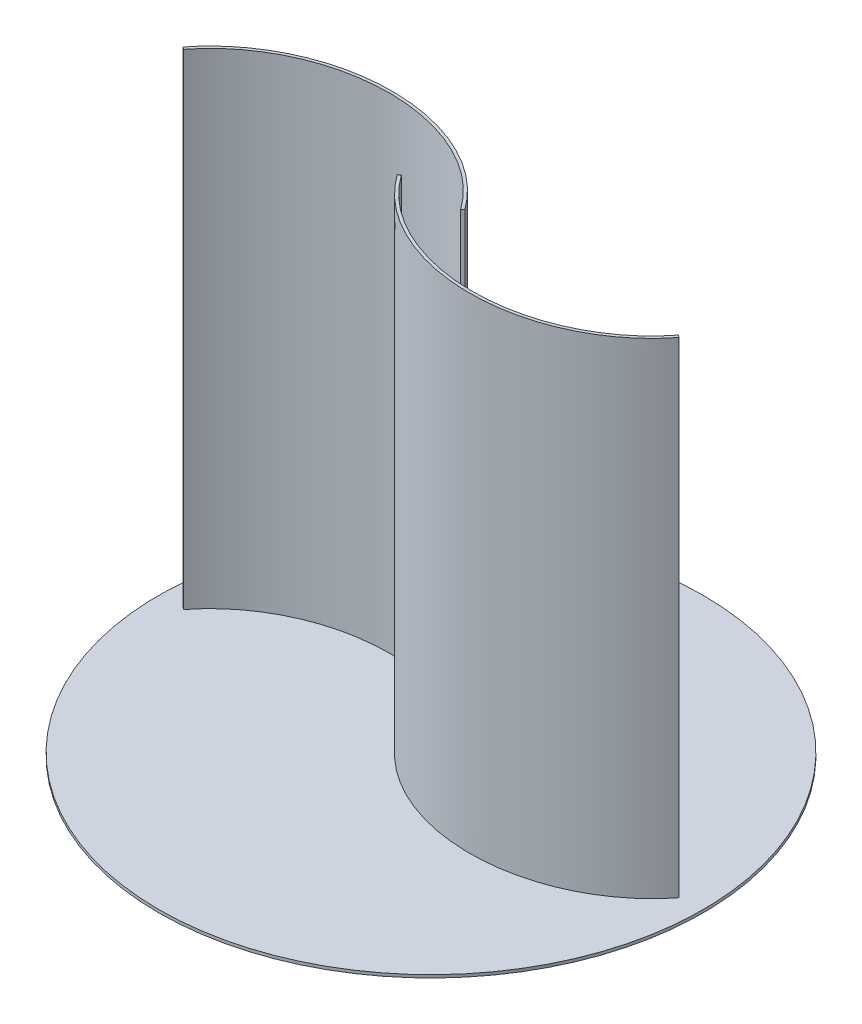
ISO-10303-21;
HEADER;
FILE_DESCRIPTION(('STEP AP214'),'2;1');
FILE_NAME('part.step','',(''),(''),'','','');
FILE_SCHEMA(('AUTOMOTIVE_DESIGN { 1 0 10303 214 1 1 1 1 }'));
ENDSEC;
DATA;
#1=APPLICATION_CONTEXT('core data for automotive mechanical design processes');
#2=APPLICATION_PROTOCOL_DEFINITION('international standard','automotive_design',2000,#1);
#3=PRODUCT_CONTEXT('',#1,'mechanical');
#4=PRODUCT('Part','Part','',(#3));
#5=PRODUCT_RELATED_PRODUCT_CATEGORY('part','',(#4));
#6=PRODUCT_DEFINITION_FORMATION('','',#4);
#7=PRODUCT_DEFINITION_CONTEXT('part definition',#1,'design');
#8=PRODUCT_DEFINITION('design','',#6,#7);
#9=PRODUCT_DEFINITION_SHAPE('','',#8);
#10=(LENGTH_UNIT() NAMED_UNIT(*) SI_UNIT(.MILLI.,.METRE.));
#11=(NAMED_UNIT(*) PLANE_ANGLE_UNIT() SI_UNIT($,.RADIAN.));
#12=(NAMED_UNIT(*) SI_UNIT($,.STERADIAN.) SOLID_ANGLE_UNIT());
#13=UNCERTAINTY_MEASURE_WITH_UNIT(LENGTH_MEASURE(1.E-05),#10,'distance_accuracy_value','');
#14=(GEOMETRIC_REPRESENTATION_CONTEXT(3) GLOBAL_UNCERTAINTY_ASSIGNED_CONTEXT((#13)) GLOBAL_UNIT_ASSIGNED_CONTEXT((#10,
#11,#12)) REPRESENTATION_CONTEXT('',''));
#15=CARTESIAN_POINT('',(0.,0.,0.));
#16=DIRECTION('',(0.,0.,1.));
#17=DIRECTION('',(1.,0.,0.));
#18=AXIS2_PLACEMENT_3D('',#15,#16,#17);
#19=CARTESIAN_POINT('',(0.,0.,0.));
#20=DIRECTION('',(0.,-1.,0.));
#21=DIRECTION('',(0.,0.,-1.));
#22=AXIS2_PLACEMENT_3D('',#19,#20,#21);
#23=PLANE('',#22);
#24=CARTESIAN_POINT('',(0.,0.,0.));
#25=DIRECTION('',(0.,-1.,0.));
#26=DIRECTION('',(0.,0.,-1.));
#27=AXIS2_PLACEMENT_3D('',#24,#25,#26);
#28=CIRCLE('',#27,280.5);
#29=CARTESIAN_POINT('',(0.,0.,-280.5));
#30=VERTEX_POINT('',#29);
#31=EDGE_CURVE('E133',#30,#30,#28,.T.);
#32=ORIENTED_EDGE('',*,*,#31,.F.);
#33=EDGE_LOOP('',(#32));
#34=FACE_BOUND('',#33,.T.);
#35=CARTESIAN_POINT('',(33.0451927941473,0.,-1.73811167634576));
#36=CARTESIAN_POINT('',(29.3253314184872,0.,-6.97124965866085));
#37=CARTESIAN_POINT('',(25.2176257591611,0.,-11.9921044919917));
#38=CARTESIAN_POINT('',(16.29295900648,0.,-21.5311522768435));
#39=CARTESIAN_POINT('',(11.4760419055099,0.,-26.0493166090416));
#40=CARTESIAN_POINT('',(1.21006722699719,0.,-34.5133467381479));
#41=CARTESIAN_POINT('',(-4.23894621330922,0.,-38.4591884806637));
#42=CARTESIAN_POINT('',(-15.682725138673,0.,-45.718247967155));
#43=CARTESIAN_POINT('',(-21.6774453697155,0.,-49.0314447800137));
#44=CARTESIAN_POINT('',(-34.1183127164376,0.,-54.9748706404852));
#45=CARTESIAN_POINT('',(-40.5644124824296,0.,-57.6050817093426));
#46=CARTESIAN_POINT('',(-53.8071626363303,0.,-62.1427579054054));
#47=CARTESIAN_POINT('',(-60.6037631254984,0.,-64.0502085679069));
#48=CARTESIAN_POINT('',(-74.4415449139929,0.,-67.1136405907596));
#49=CARTESIAN_POINT('',(-81.4826739145359,0.,-68.2696117858482));
#50=CARTESIAN_POINT('',(-95.6999834283976,0.,-69.8127888518585));
#51=CARTESIAN_POINT('',(-102.876109858721,0.,-70.1999895474854));
#52=CARTESIAN_POINT('',(-117.251923934591,0.,-70.1999895474854));
#53=CARTESIAN_POINT('',(-124.451556616485,0.,-69.8127891130524));
#54=CARTESIAN_POINT('',(-138.762571324868,0.,-68.2700859300607));
#55=CARTESIAN_POINT('',(-145.873898544061,0.,-67.1145890316524));
#56=CARTESIAN_POINT('',(-159.897819571624,0.,-64.0530357793261));
#57=CARTESIAN_POINT('',(-166.810359775546,0.,-62.1469907165298));
#58=CARTESIAN_POINT('',(-180.329183360728,0.,-57.6134697902052));
#59=CARTESIAN_POINT('',(-186.935415281964,0.,-54.9860102237033));
#60=CARTESIAN_POINT('',(-199.738637725169,0.,-49.0497589496216));
#61=CARTESIAN_POINT('',(-205.935579639696,0.,-45.7409878639663));
#62=CARTESIAN_POINT('',(-217.823279808775,0.,-38.492625566273));
#63=CARTESIAN_POINT('',(-223.513992632857,0.,-34.5530584810622));
#64=CARTESIAN_POINT('',(-234.299746055688,0.,-26.1033550785758));
#65=CARTESIAN_POINT('',(-239.394744204234,0.,-21.593245666391));
#66=CARTESIAN_POINT('',(-248.908350292699,0.,-12.0716793528765));
#67=CARTESIAN_POINT('',(-253.326918032932,0.,-7.06025190353449));
#68=CARTESIAN_POINT('',(-257.371935205023,0.,-1.83682426572968));
#69=B_SPLINE_CURVE_WITH_KNOTS('',3,(#35,#36,#37,#38,#39,#40,#41,#42,#43,#44,#45,#46,#47,#48,#49,
#50,#51,#52,#53,#54,#55,#56,#57,#58,#59,#60,#61,#62,#63,#64,#65,#66,#67,#68),.UNSPECIFIED.,.F.,
.F.,(4,2,2,2,2,2,2,2,2,2,2,2,2,2,2,2,4),(0.,0.0625,0.125,0.1875,0.25,0.3125,0.375,0.4375,0.5,
0.5625,0.625,0.6875,0.75,0.8125,0.875,0.9375,1.),.UNSPECIFIED.);
#70=CARTESIAN_POINT('',(33.0451927941473,0.,-1.73811167634581));
#71=VERTEX_POINT('',#70);
#72=CARTESIAN_POINT('',(-257.371935205023,0.,-1.83682426572968));
#73=VERTEX_POINT('',#72);
#74=EDGE_CURVE('E187',#71,#73,#69,.T.);
#75=ORIENTED_EDGE('',*,*,#74,.F.);
#76=DIRECTION('',(-0.815064264715779,0.,0.579370558781965));
#77=VECTOR('',#76,1.);
#78=CARTESIAN_POINT('',(33.0451927941473,0.,-1.73811167634581));
#79=LINE('',#78,#77);
#80=CARTESIAN_POINT('',(30.6,0.,0.));
#81=VERTEX_POINT('',#80);
#82=EDGE_CURVE('E201',#71,#81,#79,.T.);
#83=ORIENTED_EDGE('',*,*,#82,.T.);
#84=CARTESIAN_POINT('',(-114.679331484579,0.,78.0020448605837));
#85=DIRECTION('',(0.,1.,0.));
#86=DIRECTION('',(-0.996194698091746,0.,0.0871557427476549));
#87=AXIS2_PLACEMENT_3D('',#84,#85,#86);
#88=ELLIPSE('',#87,169.539126486376,145.);
#89=CARTESIAN_POINT('',(-255.,0.,0.));
#90=VERTEX_POINT('',#89);
#91=EDGE_CURVE('E198',#81,#90,#88,.T.);
#92=ORIENTED_EDGE('',*,*,#91,.T.);
#93=DIRECTION('',(-0.790645068340939,0.,-0.612274755243226));
#94=VECTOR('',#93,1.);
#95=CARTESIAN_POINT('',(-255.,0.,0.));
#96=LINE('',#95,#94);
#97=EDGE_CURVE('E191',#90,#73,#96,.T.);
#98=ORIENTED_EDGE('',*,*,#97,.T.);
#99=EDGE_LOOP('',(#75,#83,#92,#98));
#100=FACE_BOUND('',#99,.T.);
#101=CARTESIAN_POINT('',(-33.0451927941476,0.,1.73811167634623));
#102=CARTESIAN_POINT('',(-29.3253314184876,0.,6.97124965866137));
#103=CARTESIAN_POINT('',(-25.2176257591614,0.,11.9921044919922));
#104=CARTESIAN_POINT('',(-16.2929590064803,0.,21.5311522768441));
#105=CARTESIAN_POINT('',(-11.4760419055102,0.,26.0493166090423));
#106=CARTESIAN_POINT('',(-1.21006722699743,0.,34.5133467381487));
#107=CARTESIAN_POINT('',(4.23894621330905,0.,38.4591884806646));
#108=CARTESIAN_POINT('',(15.6827251386728,0.,45.718247967156));
#109=CARTESIAN_POINT('',(21.6774453697153,0.,49.0314447800146));
#110=CARTESIAN_POINT('',(34.1183127164374,0.,54.9748706404861));
#111=CARTESIAN_POINT('',(40.5644124824293,0.,57.6050817093436));
#112=CARTESIAN_POINT('',(53.8071626363301,0.,62.1427579054064));
#113=CARTESIAN_POINT('',(60.6037631254983,0.,64.0502085679079));
#114=CARTESIAN_POINT('',(74.4415449139928,0.,67.1136405907606));
#115=CARTESIAN_POINT('',(81.4826739145359,0.,68.2696117858492));
#116=CARTESIAN_POINT('',(95.6999834283976,0.,69.8127888518596));
#117=CARTESIAN_POINT('',(102.876109858721,0.,70.1999895474864));
#118=CARTESIAN_POINT('',(117.251923934591,0.,70.1999895474865));
#119=CARTESIAN_POINT('',(124.451556616485,0.,69.8127891130535));
#120=CARTESIAN_POINT('',(138.762571324868,0.,68.2700859300617));
#121=CARTESIAN_POINT('',(145.873898544061,0.,67.1145890316534));
#122=CARTESIAN_POINT('',(159.897819571624,0.,64.053035779327));
#123=CARTESIAN_POINT('',(166.810359775546,0.,62.1469907165307));
#124=CARTESIAN_POINT('',(180.329183360728,0.,57.6134697902061));
#125=CARTESIAN_POINT('',(186.935415281964,0.,54.9860102237042));
#126=CARTESIAN_POINT('',(199.738637725169,0.,49.0497589496224));
#127=CARTESIAN_POINT('',(205.935579639696,0.,45.7409878639671));
#128=CARTESIAN_POINT('',(217.823279808775,0.,38.4926255662737));
#129=CARTESIAN_POINT('',(223.513992632857,0.,34.5530584810628));
#130=CARTESIAN_POINT('',(234.299746055688,0.,26.1033550785763));
#131=CARTESIAN_POINT('',(239.394744204234,0.,21.5932456663915));
#132=CARTESIAN_POINT('',(248.908350292699,0.,12.0716793528769));
#133=CARTESIAN_POINT('',(253.326918032933,0.,7.06025190353481));
#134=CARTESIAN_POINT('',(257.371935205023,0.,1.83682426572999));
#135=B_SPLINE_CURVE_WITH_KNOTS('',3,(#101,#102,#103,#104,#105,#106,#107,#108,#109,#110,#111,
#112,#113,#114,#115,#116,#117,#118,#119,#120,#121,#122,#123,#124,#125,#126,#127,#128,#129,#130,
#131,#132,#133,#134),.UNSPECIFIED.,.F.,.F.,(4,2,2,2,2,2,2,2,2,2,2,2,2,2,2,2,4),(0.,0.0625,0.125,
0.1875,0.25,0.3125,0.375,0.4375,0.5,0.5625,0.625,0.6875,0.75,0.8125,0.875,0.9375,1.),.UNSPECIFIED.);
#136=CARTESIAN_POINT('',(-33.0451927941477,0.,1.73811167634617));
#137=VERTEX_POINT('',#136);
#138=CARTESIAN_POINT('',(257.371935205023,0.,1.83682426572994));
#139=VERTEX_POINT('',#138);
#140=EDGE_CURVE('E129',#137,#139,#135,.T.);
#141=ORIENTED_EDGE('',*,*,#140,.F.);
#142=DIRECTION('',(0.815064264715782,0.,-0.579370558781961));
#143=VECTOR('',#142,1.);
#144=CARTESIAN_POINT('',(-33.0451927941477,0.,1.73811167634617));
#145=LINE('',#144,#143);
#146=CARTESIAN_POINT('',(-30.6000000000003,0.,2.8796409701215E-13));
#147=VERTEX_POINT('',#146);
#148=EDGE_CURVE('E123',#137,#147,#145,.T.);
#149=ORIENTED_EDGE('',*,*,#148,.T.);
#150=CARTESIAN_POINT('',(114.679331484579,0.,-78.0020448605833));
#151=DIRECTION('',(0.,1.,0.));
#152=DIRECTION('',(0.996194698091746,0.,-0.0871557427476582));
#153=AXIS2_PLACEMENT_3D('',#150,#151,#152);
#154=ELLIPSE('',#153,169.539126486376,145.000000000001);
#155=CARTESIAN_POINT('',(255.,0.,2.63677968348475E-13));
#156=VERTEX_POINT('',#155);
#157=EDGE_CURVE('E55',#147,#156,#154,.T.);
#158=ORIENTED_EDGE('',*,*,#157,.T.);
#159=DIRECTION('',(0.790645068340941,0.,0.612274755243223));
#160=VECTOR('',#159,1.);
#161=CARTESIAN_POINT('',(255.,0.,2.63677968348475E-13));
#162=LINE('',#161,#160);
#163=EDGE_CURVE('E233',#156,#139,#162,.T.);
#164=ORIENTED_EDGE('',*,*,#163,.T.);
#165=EDGE_LOOP('',(#141,#149,#158,#164));
#166=FACE_BOUND('',#165,.T.);
#167=ADVANCED_FACE('F39',(#34,#100,#166),#23,.F.);
#168=CARTESIAN_POINT('',(33.0451927941473,500.,-1.73811167634576));
#169=CARTESIAN_POINT('',(29.3253314184872,500.,-6.97124965866085));
#170=CARTESIAN_POINT('',(25.2176257591611,500.,-11.9921044919917));
#171=CARTESIAN_POINT('',(16.29295900648,500.,-21.5311522768435));
#172=CARTESIAN_POINT('',(11.4760419055099,500.,-26.0493166090416));
#173=CARTESIAN_POINT('',(1.21006722699719,500.,-34.5133467381479));
#174=CARTESIAN_POINT('',(-4.23894621330922,500.,-38.4591884806637));
#175=CARTESIAN_POINT('',(-15.682725138673,500.,-45.718247967155));
#176=CARTESIAN_POINT('',(-21.6774453697155,500.,-49.0314447800137));
#177=CARTESIAN_POINT('',(-34.1183127164376,500.,-54.9748706404852));
#178=CARTESIAN_POINT('',(-40.5644124824296,500.,-57.6050817093426));
#179=CARTESIAN_POINT('',(-53.8071626363303,500.,-62.1427579054054));
#180=CARTESIAN_POINT('',(-60.6037631254984,500.,-64.0502085679069));
#181=CARTESIAN_POINT('',(-74.4415449139929,500.,-67.1136405907596));
#182=CARTESIAN_POINT('',(-81.4826739145359,500.,-68.2696117858482));
#183=CARTESIAN_POINT('',(-95.6999834283976,500.,-69.8127888518585));
#184=CARTESIAN_POINT('',(-102.876109858721,500.,-70.1999895474854));
#185=CARTESIAN_POINT('',(-117.251923934591,500.,-70.1999895474854));
#186=CARTESIAN_POINT('',(-124.451556616485,500.,-69.8127891130524));
#187=CARTESIAN_POINT('',(-138.762571324868,500.,-68.2700859300607));
#188=CARTESIAN_POINT('',(-145.873898544061,500.,-67.1145890316524));
#189=CARTESIAN_POINT('',(-159.897819571624,500.,-64.0530357793261));
#190=CARTESIAN_POINT('',(-166.810359775546,500.,-62.1469907165298));
#191=CARTESIAN_POINT('',(-180.329183360728,500.,-57.6134697902052));
#192=CARTESIAN_POINT('',(-186.935415281964,500.,-54.9860102237033));
#193=CARTESIAN_POINT('',(-199.738637725169,500.,-49.0497589496216));
#194=CARTESIAN_POINT('',(-205.935579639696,500.,-45.7409878639663));
#195=CARTESIAN_POINT('',(-217.823279808775,500.,-38.492625566273));
#196=CARTESIAN_POINT('',(-223.513992632857,500.,-34.5530584810622));
#197=CARTESIAN_POINT('',(-234.299746055688,500.,-26.1033550785758));
#198=CARTESIAN_POINT('',(-239.394744204234,500.,-21.593245666391));
#199=CARTESIAN_POINT('',(-248.908350292699,500.,-12.0716793528765));
#200=CARTESIAN_POINT('',(-253.326918032932,500.,-7.06025190353449));
#201=CARTESIAN_POINT('',(-257.371935205023,500.,-1.83682426572968));
#202=B_SPLINE_CURVE_WITH_KNOTS('',3,(#168,#169,#170,#171,#172,#173,#174,#175,#176,#177,#178,
#179,#180,#181,#182,#183,#184,#185,#186,#187,#188,#189,#190,#191,#192,#193,#194,#195,#196,#197,
#198,#199,#200,#201),.UNSPECIFIED.,.F.,.F.,(4,2,2,2,2,2,2,2,2,2,2,2,2,2,2,2,4),(0.,0.0625,0.125,
0.1875,0.25,0.3125,0.375,0.4375,0.5,0.5625,0.625,0.6875,0.75,0.8125,0.875,0.9375,1.),.UNSPECIFIED.);
#203=DIRECTION('',(0.,-1.,0.));
#204=VECTOR('',#203,1.);
#205=SURFACE_OF_LINEAR_EXTRUSION('',#202,#204);
#206=ORIENTED_EDGE('',*,*,#74,.T.);
#207=DIRECTION('',(0.,-1.,0.));
#208=VECTOR('',#207,1.);
#209=CARTESIAN_POINT('',(-257.371935205023,500.,-1.83682426572968));
#210=LINE('',#209,#208);
#211=CARTESIAN_POINT('',(-257.371935205023,500.,-1.83682426572968));
#212=VERTEX_POINT('',#211);
#213=EDGE_CURVE('E11',#212,#73,#210,.T.);
#214=ORIENTED_EDGE('',*,*,#213,.F.);
#215=CARTESIAN_POINT('',(33.0451927941473,500.,-1.73811167634581));
#216=VERTEX_POINT('',#215);
#217=EDGE_CURVE('E86',#216,#212,#202,.T.);
#218=ORIENTED_EDGE('',*,*,#217,.F.);
#219=DIRECTION('',(0.,-1.,0.));
#220=VECTOR('',#219,1.);
#221=CARTESIAN_POINT('',(33.0451927941473,500.,-1.73811167634581));
#222=LINE('',#221,#220);
#223=EDGE_CURVE('E64',#216,#71,#222,.T.);
#224=ORIENTED_EDGE('',*,*,#223,.T.);
#225=EDGE_LOOP('',(#206,#214,#218,#224));
#226=FACE_BOUND('',#225,.T.);
#227=ADVANCED_FACE('F41',(#226),#205,.F.);
#228=CARTESIAN_POINT('',(-255.,500.,0.));
#229=DIRECTION('',(-0.612274755243226,0.,0.790645068340939));
#230=DIRECTION('',(0.790645068340939,0.,0.612274755243226));
#231=AXIS2_PLACEMENT_3D('',#228,#229,#230);
#232=PLANE('',#231);
#233=ORIENTED_EDGE('',*,*,#97,.F.);
#234=DIRECTION('',(0.,-1.,0.));
#235=VECTOR('',#234,1.);
#236=CARTESIAN_POINT('',(-255.,500.,0.));
#237=LINE('',#236,#235);
#238=CARTESIAN_POINT('',(-255.,500.,0.));
#239=VERTEX_POINT('',#238);
#240=EDGE_CURVE('E48',#239,#90,#237,.T.);
#241=ORIENTED_EDGE('',*,*,#240,.F.);
#242=DIRECTION('',(-0.790645068340939,0.,-0.612274755243226));
#243=VECTOR('',#242,1.);
#244=CARTESIAN_POINT('',(-255.,500.,0.));
#245=LINE('',#244,#243);
#246=EDGE_CURVE('E185',#239,#212,#245,.T.);
#247=ORIENTED_EDGE('',*,*,#246,.T.);
#248=ORIENTED_EDGE('',*,*,#213,.T.);
#249=EDGE_LOOP('',(#233,#241,#247,#248));
#250=FACE_BOUND('',#249,.T.);
#251=ADVANCED_FACE('F177',(#250),#232,.T.);
#252=CARTESIAN_POINT('',(-114.679331484579,500.,78.0020448605837));
#253=DIRECTION('',(0.,1.,0.));
#254=DIRECTION('',(-0.996194698091746,0.,0.0871557427476549));
#255=AXIS2_PLACEMENT_3D('',#252,#253,#254);
#256=ELLIPSE('',#255,169.539126486376,145.);
#257=DIRECTION('',(0.,-1.,0.));
#258=VECTOR('',#257,1.);
#259=SURFACE_OF_LINEAR_EXTRUSION('',#256,#258);
#260=ORIENTED_EDGE('',*,*,#91,.F.);
#261=DIRECTION('',(0.,-1.,0.));
#262=VECTOR('',#261,1.);
#263=CARTESIAN_POINT('',(30.6,500.,0.));
#264=LINE('',#263,#262);
#265=CARTESIAN_POINT('',(30.6,500.,0.));
#266=VERTEX_POINT('',#265);
#267=EDGE_CURVE('E205',#266,#81,#264,.T.);
#268=ORIENTED_EDGE('',*,*,#267,.F.);
#269=EDGE_CURVE('E179',#266,#239,#256,.T.);
#270=ORIENTED_EDGE('',*,*,#269,.T.);
#271=ORIENTED_EDGE('',*,*,#240,.T.);
#272=EDGE_LOOP('',(#260,#268,#270,#271));
#273=FACE_BOUND('',#272,.T.);
#274=ADVANCED_FACE('F174',(#273),#259,.T.);
#275=CARTESIAN_POINT('',(33.0451927941473,500.,-1.73811167634581));
#276=DIRECTION('',(0.579370558781965,0.,0.815064264715779));
#277=DIRECTION('',(0.815064264715779,0.,-0.579370558781965));
#278=AXIS2_PLACEMENT_3D('',#275,#276,#277);
#279=PLANE('',#278);
#280=ORIENTED_EDGE('',*,*,#82,.F.);
#281=ORIENTED_EDGE('',*,*,#223,.F.);
#282=DIRECTION('',(-0.815064264715779,0.,0.579370558781965));
#283=VECTOR('',#282,1.);
#284=CARTESIAN_POINT('',(33.0451927941473,500.,-1.73811167634581));
#285=LINE('',#284,#283);
#286=EDGE_CURVE('E184',#216,#266,#285,.T.);
#287=ORIENTED_EDGE('',*,*,#286,.T.);
#288=ORIENTED_EDGE('',*,*,#267,.T.);
#289=EDGE_LOOP('',(#280,#281,#287,#288));
#290=FACE_BOUND('',#289,.T.);
#291=ADVANCED_FACE('F171',(#290),#279,.T.);
#292=CARTESIAN_POINT('',(-110.064016896656,500.,-70.1999895474854));
#293=DIRECTION('',(0.,-1.,0.));
#294=DIRECTION('',(-1.,0.,0.));
#295=AXIS2_PLACEMENT_3D('',#292,#293,#294);
#296=PLANE('',#295);
#297=ORIENTED_EDGE('',*,*,#217,.T.);
#298=ORIENTED_EDGE('',*,*,#246,.F.);
#299=ORIENTED_EDGE('',*,*,#269,.F.);
#300=ORIENTED_EDGE('',*,*,#286,.F.);
#301=EDGE_LOOP('',(#297,#298,#299,#300));
#302=FACE_BOUND('',#301,.T.);
#303=ADVANCED_FACE('F167',(#302),#296,.F.);
#304=CARTESIAN_POINT('',(0.,-3.,0.));
#305=DIRECTION('',(0.,1.,0.));
#306=DIRECTION('',(0.,0.,1.));
#307=AXIS2_PLACEMENT_3D('',#304,#305,#306);
#308=CYLINDRICAL_SURFACE('',#307,280.5);
#309=CARTESIAN_POINT('',(0.,-3.,0.));
#310=DIRECTION('',(0.,-1.,0.));
#311=DIRECTION('',(0.,0.,-1.));
#312=AXIS2_PLACEMENT_3D('',#309,#310,#311);
#313=CIRCLE('',#312,280.5);
#314=CARTESIAN_POINT('',(0.,-3.,-280.5));
#315=VERTEX_POINT('',#314);
#316=EDGE_CURVE('E192',#315,#315,#313,.T.);
#317=ORIENTED_EDGE('',*,*,#316,.F.);
#318=EDGE_LOOP('',(#317));
#319=FACE_BOUND('',#318,.T.);
#320=ORIENTED_EDGE('',*,*,#31,.T.);
#321=EDGE_LOOP('',(#320));
#322=FACE_BOUND('',#321,.T.);
#323=ADVANCED_FACE('F160',(#319,#322),#308,.T.);
#324=CARTESIAN_POINT('',(0.,-3.,0.));
#325=DIRECTION('',(0.,-1.,0.));
#326=DIRECTION('',(0.,0.,-1.));
#327=AXIS2_PLACEMENT_3D('',#324,#325,#326);
#328=PLANE('',#327);
#329=ORIENTED_EDGE('',*,*,#316,.T.);
#330=EDGE_LOOP('',(#329));
#331=FACE_BOUND('',#330,.T.);
#332=ADVANCED_FACE('F157',(#331),#328,.T.);
#333=CARTESIAN_POINT('',(-33.0451927941476,500.,1.73811167634623));
#334=CARTESIAN_POINT('',(-29.3253314184876,500.,6.97124965866137));
#335=CARTESIAN_POINT('',(-25.2176257591614,500.,11.9921044919922));
#336=CARTESIAN_POINT('',(-16.2929590064803,500.,21.5311522768441));
#337=CARTESIAN_POINT('',(-11.4760419055102,500.,26.0493166090423));
#338=CARTESIAN_POINT('',(-1.21006722699743,500.,34.5133467381487));
#339=CARTESIAN_POINT('',(4.23894621330905,500.,38.4591884806646));
#340=CARTESIAN_POINT('',(15.6827251386728,500.,45.718247967156));
#341=CARTESIAN_POINT('',(21.6774453697153,500.,49.0314447800146));
#342=CARTESIAN_POINT('',(34.1183127164374,500.,54.9748706404861));
#343=CARTESIAN_POINT('',(40.5644124824293,500.,57.6050817093436));
#344=CARTESIAN_POINT('',(53.8071626363301,500.,62.1427579054064));
#345=CARTESIAN_POINT('',(60.6037631254983,500.,64.0502085679079));
#346=CARTESIAN_POINT('',(74.4415449139928,500.,67.1136405907606));
#347=CARTESIAN_POINT('',(81.4826739145359,500.,68.2696117858492));
#348=CARTESIAN_POINT('',(95.6999834283976,500.,69.8127888518596));
#349=CARTESIAN_POINT('',(102.876109858721,500.,70.1999895474864));
#350=CARTESIAN_POINT('',(117.251923934591,500.,70.1999895474865));
#351=CARTESIAN_POINT('',(124.451556616485,500.,69.8127891130535));
#352=CARTESIAN_POINT('',(138.762571324868,500.,68.2700859300617));
#353=CARTESIAN_POINT('',(145.873898544061,500.,67.1145890316534));
#354=CARTESIAN_POINT('',(159.897819571624,500.,64.053035779327));
#355=CARTESIAN_POINT('',(166.810359775546,500.,62.1469907165307));
#356=CARTESIAN_POINT('',(180.329183360728,500.,57.6134697902061));
#357=CARTESIAN_POINT('',(186.935415281964,500.,54.9860102237042));
#358=CARTESIAN_POINT('',(199.738637725169,500.,49.0497589496224));
#359=CARTESIAN_POINT('',(205.935579639696,500.,45.7409878639671));
#360=CARTESIAN_POINT('',(217.823279808775,500.,38.4926255662737));
#361=CARTESIAN_POINT('',(223.513992632857,500.,34.5530584810628));
#362=CARTESIAN_POINT('',(234.299746055688,500.,26.1033550785763));
#363=CARTESIAN_POINT('',(239.394744204234,500.,21.5932456663915));
#364=CARTESIAN_POINT('',(248.908350292699,500.,12.0716793528769));
#365=CARTESIAN_POINT('',(253.326918032933,500.,7.06025190353481));
#366=CARTESIAN_POINT('',(257.371935205023,500.,1.83682426572999));
#367=B_SPLINE_CURVE_WITH_KNOTS('',3,(#333,#334,#335,#336,#337,#338,#339,#340,#341,#342,#343,
#344,#345,#346,#347,#348,#349,#350,#351,#352,#353,#354,#355,#356,#357,#358,#359,#360,#361,#362,
#363,#364,#365,#366),.UNSPECIFIED.,.F.,.F.,(4,2,2,2,2,2,2,2,2,2,2,2,2,2,2,2,4),(0.,0.0625,0.125,
0.1875,0.25,0.3125,0.375,0.4375,0.5,0.5625,0.625,0.6875,0.75,0.8125,0.875,0.9375,1.),.UNSPECIFIED.);
#368=DIRECTION('',(0.,-1.,0.));
#369=VECTOR('',#368,1.);
#370=SURFACE_OF_LINEAR_EXTRUSION('',#367,#369);
#371=ORIENTED_EDGE('',*,*,#140,.T.);
#372=DIRECTION('',(0.,-1.,0.));
#373=VECTOR('',#372,1.);
#374=CARTESIAN_POINT('',(257.371935205023,500.,1.83682426572994));
#375=LINE('',#374,#373);
#376=CARTESIAN_POINT('',(257.371935205023,500.,1.83682426572994));
#377=VERTEX_POINT('',#376);
#378=EDGE_CURVE('E126',#377,#139,#375,.T.);
#379=ORIENTED_EDGE('',*,*,#378,.F.);
#380=CARTESIAN_POINT('',(-33.0451927941477,500.,1.73811167634617));
#381=VERTEX_POINT('',#380);
#382=EDGE_CURVE('E113',#381,#377,#367,.T.);
#383=ORIENTED_EDGE('',*,*,#382,.F.);
#384=DIRECTION('',(0.,-1.,0.));
#385=VECTOR('',#384,1.);
#386=CARTESIAN_POINT('',(-33.0451927941477,500.,1.73811167634617));
#387=LINE('',#386,#385);
#388=EDGE_CURVE('E228',#381,#137,#387,.T.);
#389=ORIENTED_EDGE('',*,*,#388,.T.);
#390=EDGE_LOOP('',(#371,#379,#383,#389));
#391=FACE_BOUND('',#390,.T.);
#392=ADVANCED_FACE('F127',(#391),#370,.F.);
#393=CARTESIAN_POINT('',(255.,500.,2.63677968348475E-13));
#394=DIRECTION('',(0.612274755243223,0.,-0.790645068340941));
#395=DIRECTION('',(-0.790645068340941,0.,-0.612274755243223));
#396=AXIS2_PLACEMENT_3D('',#393,#394,#395);
#397=PLANE('',#396);
#398=ORIENTED_EDGE('',*,*,#163,.F.);
#399=DIRECTION('',(0.,-1.,0.));
#400=VECTOR('',#399,1.);
#401=CARTESIAN_POINT('',(255.,500.,2.63677968348475E-13));
#402=LINE('',#401,#400);
#403=CARTESIAN_POINT('',(255.,500.,2.63677968348475E-13));
#404=VERTEX_POINT('',#403);
#405=EDGE_CURVE('E134',#404,#156,#402,.T.);
#406=ORIENTED_EDGE('',*,*,#405,.F.);
#407=DIRECTION('',(0.790645068340941,0.,0.612274755243223));
#408=VECTOR('',#407,1.);
#409=CARTESIAN_POINT('',(255.,500.,2.63677968348475E-13));
#410=LINE('',#409,#408);
#411=EDGE_CURVE('E118',#404,#377,#410,.T.);
#412=ORIENTED_EDGE('',*,*,#411,.T.);
#413=ORIENTED_EDGE('',*,*,#378,.T.);
#414=EDGE_LOOP('',(#398,#406,#412,#413));
#415=FACE_BOUND('',#414,.T.);
#416=ADVANCED_FACE('F136',(#415),#397,.T.);
#417=CARTESIAN_POINT('',(114.679331484579,500.,-78.0020448605833));
#418=DIRECTION('',(0.,1.,0.));
#419=DIRECTION('',(0.996194698091746,0.,-0.0871557427476582));
#420=AXIS2_PLACEMENT_3D('',#417,#418,#419);
#421=ELLIPSE('',#420,169.539126486376,145.000000000001);
#422=DIRECTION('',(0.,-1.,0.));
#423=VECTOR('',#422,1.);
#424=SURFACE_OF_LINEAR_EXTRUSION('',#421,#423);
#425=ORIENTED_EDGE('',*,*,#157,.F.);
#426=DIRECTION('',(0.,-1.,0.));
#427=VECTOR('',#426,1.);
#428=CARTESIAN_POINT('',(-30.6000000000003,500.,2.9316826744008E-13));
#429=LINE('',#428,#427);
#430=CARTESIAN_POINT('',(-30.6000000000003,500.,2.9316826744008E-13));
#431=VERTEX_POINT('',#430);
#432=EDGE_CURVE('E226',#431,#147,#429,.T.);
#433=ORIENTED_EDGE('',*,*,#432,.F.);
#434=EDGE_CURVE('E137',#431,#404,#421,.T.);
#435=ORIENTED_EDGE('',*,*,#434,.T.);
#436=ORIENTED_EDGE('',*,*,#405,.T.);
#437=EDGE_LOOP('',(#425,#433,#435,#436));
#438=FACE_BOUND('',#437,.T.);
#439=ADVANCED_FACE('F147',(#438),#424,.T.);
#440=CARTESIAN_POINT('',(-33.0451927941477,500.,1.73811167634617));
#441=DIRECTION('',(-0.579370558781961,0.,-0.815064264715782));
#442=DIRECTION('',(-0.815064264715782,0.,0.579370558781961));
#443=AXIS2_PLACEMENT_3D('',#440,#441,#442);
#444=PLANE('',#443);
#445=ORIENTED_EDGE('',*,*,#148,.F.);
#446=ORIENTED_EDGE('',*,*,#388,.F.);
#447=DIRECTION('',(0.815064264715782,0.,-0.579370558781961));
#448=VECTOR('',#447,1.);
#449=CARTESIAN_POINT('',(-33.0451927941477,500.,1.73811167634617));
#450=LINE('',#449,#448);
#451=EDGE_CURVE('E121',#381,#431,#450,.T.);
#452=ORIENTED_EDGE('',*,*,#451,.T.);
#453=ORIENTED_EDGE('',*,*,#432,.T.);
#454=EDGE_LOOP('',(#445,#446,#452,#453));
#455=FACE_BOUND('',#454,.T.);
#456=ADVANCED_FACE('F151',(#455),#444,.T.);
#457=CARTESIAN_POINT('',(110.064016896656,500.,70.1999895474865));
#458=DIRECTION('',(0.,-1.,0.));
#459=DIRECTION('',(-1.,0.,0.));
#460=AXIS2_PLACEMENT_3D('',#457,#458,#459);
#461=PLANE('',#460);
#462=ORIENTED_EDGE('',*,*,#382,.T.);
#463=ORIENTED_EDGE('',*,*,#411,.F.);
#464=ORIENTED_EDGE('',*,*,#434,.F.);
#465=ORIENTED_EDGE('',*,*,#451,.F.);
#466=EDGE_LOOP('',(#462,#463,#464,#465));
#467=FACE_BOUND('',#466,.T.);
#468=ADVANCED_FACE('F115',(#467),#461,.F.);
#469=CLOSED_SHELL('',(#167,#227,#251,#274,#291,#303,#323,#332,#392,#416,#439,#456,#468));
#470=MANIFOLD_SOLID_BREP('B2',#469);
#471=ADVANCED_BREP_SHAPE_REPRESENTATION('',(#18,#470),#14);
#472=SHAPE_DEFINITION_REPRESENTATION(#9,#471);
ENDSEC;
END-ISO-10303-21;
